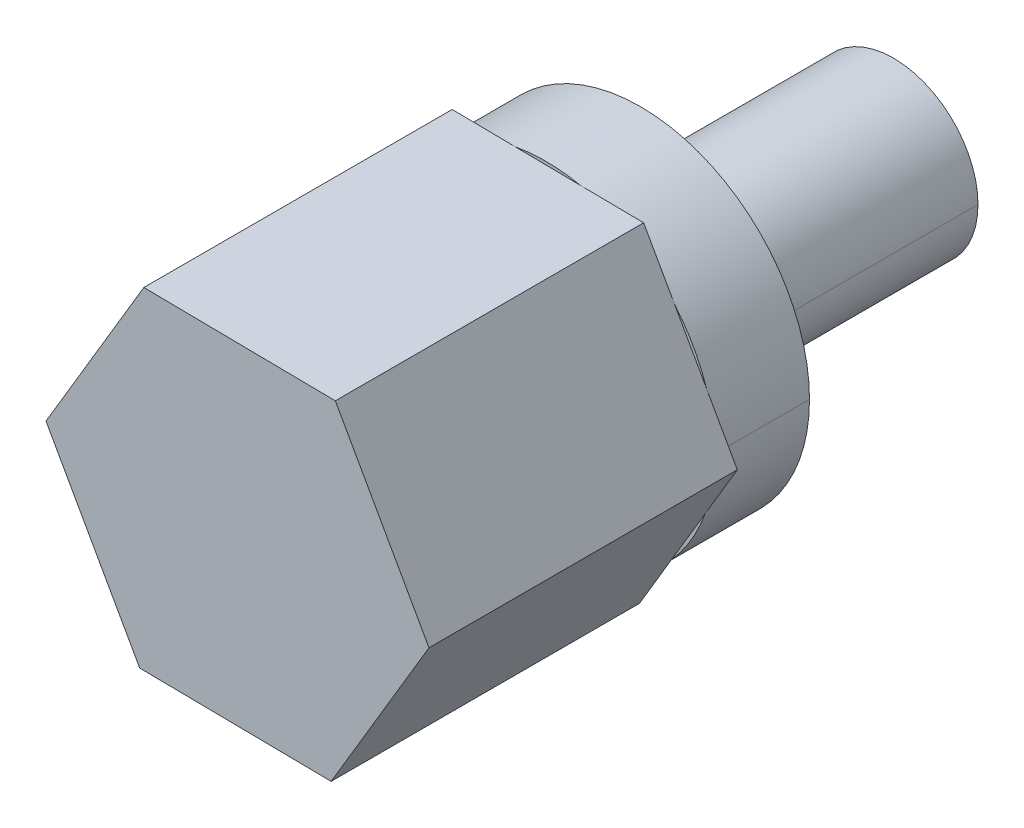
ISO-10303-21;
HEADER;
FILE_DESCRIPTION(('STEP AP214'),'2;1');
FILE_NAME('part.step','',(''),(''),'','','');
FILE_SCHEMA(('AUTOMOTIVE_DESIGN { 1 0 10303 214 1 1 1 1 }'));
ENDSEC;
DATA;
#1=APPLICATION_CONTEXT('core data for automotive mechanical design processes');
#2=APPLICATION_PROTOCOL_DEFINITION('international standard','automotive_design',2000,#1);
#3=PRODUCT_CONTEXT('',#1,'mechanical');
#4=PRODUCT('Part','Part','',(#3));
#5=PRODUCT_RELATED_PRODUCT_CATEGORY('part','',(#4));
#6=PRODUCT_DEFINITION_FORMATION('','',#4);
#7=PRODUCT_DEFINITION_CONTEXT('part definition',#1,'design');
#8=PRODUCT_DEFINITION('design','',#6,#7);
#9=PRODUCT_DEFINITION_SHAPE('','',#8);
#10=(LENGTH_UNIT() NAMED_UNIT(*) SI_UNIT(.MILLI.,.METRE.));
#11=(NAMED_UNIT(*) PLANE_ANGLE_UNIT() SI_UNIT($,.RADIAN.));
#12=(NAMED_UNIT(*) SI_UNIT($,.STERADIAN.) SOLID_ANGLE_UNIT());
#13=UNCERTAINTY_MEASURE_WITH_UNIT(LENGTH_MEASURE(1.E-05),#10,'distance_accuracy_value','');
#14=(GEOMETRIC_REPRESENTATION_CONTEXT(3) GLOBAL_UNCERTAINTY_ASSIGNED_CONTEXT((#13)) GLOBAL_UNIT_ASSIGNED_CONTEXT((#10,
#11,#12)) REPRESENTATION_CONTEXT('',''));
#15=CARTESIAN_POINT('',(0.,0.,0.));
#16=DIRECTION('',(0.,0.,1.));
#17=DIRECTION('',(1.,0.,0.));
#18=AXIS2_PLACEMENT_3D('',#15,#16,#17);
#19=CARTESIAN_POINT('',(2.23771846131786,-3.99083547241392,15.6718));
#20=DIRECTION('',(0.,0.,1.));
#21=DIRECTION('',(1.,0.,0.));
#22=AXIS2_PLACEMENT_3D('',#19,#20,#21);
#23=PLANE('',#22);
#24=DIRECTION('',(0.999921038087973,-0.0125665265316121,0.));
#25=VECTOR('',#24,1.);
#26=CARTESIAN_POINT('',(-2.33730567077559,-3.93333877022566,15.6718));
#27=LINE('',#26,#25);
#28=CARTESIAN_POINT('',(-2.33730567077559,-3.93333877022566,15.6718));
#29=VERTEX_POINT('',#28);
#30=CARTESIAN_POINT('',(2.23771846131786,-3.99083547241392,15.6718));
#31=VERTEX_POINT('',#30);
#32=EDGE_CURVE('E300',#29,#31,#27,.T.);
#33=ORIENTED_EDGE('',*,*,#32,.T.);
#34=DIRECTION('',(0.510843450257695,0.859673757496886,0.));
#35=VECTOR('',#34,1.);
#36=CARTESIAN_POINT('',(2.23771846131786,-3.99083547241392,15.6718));
#37=LINE('',#36,#35);
#38=CARTESIAN_POINT('',(4.57502413209346,-0.0574967021882604,15.6718));
#39=VERTEX_POINT('',#38);
#40=EDGE_CURVE('E350',#31,#39,#37,.T.);
#41=ORIENTED_EDGE('',*,*,#40,.T.);
#42=DIRECTION('',(-0.489077587830279,0.872240284028498,0.));
#43=VECTOR('',#42,1.);
#44=CARTESIAN_POINT('',(4.57502413209346,-0.0574967021882604,15.6718));
#45=LINE('',#44,#43);
#46=CARTESIAN_POINT('',(2.33730567077559,3.93333877022566,15.6718));
#47=VERTEX_POINT('',#46);
#48=EDGE_CURVE('E357',#39,#47,#45,.T.);
#49=ORIENTED_EDGE('',*,*,#48,.T.);
#50=DIRECTION('',(-0.999921038087973,0.0125665265316122,0.));
#51=VECTOR('',#50,1.);
#52=CARTESIAN_POINT('',(2.33730567077559,3.93333877022566,15.6718));
#53=LINE('',#52,#51);
#54=CARTESIAN_POINT('',(-2.23771846131787,3.99083547241392,15.6718));
#55=VERTEX_POINT('',#54);
#56=EDGE_CURVE('E364',#47,#55,#53,.T.);
#57=ORIENTED_EDGE('',*,*,#56,.T.);
#58=DIRECTION('',(-0.510843450257694,-0.859673757496886,0.));
#59=VECTOR('',#58,1.);
#60=CARTESIAN_POINT('',(-2.23771846131787,3.99083547241392,15.6718));
#61=LINE('',#60,#59);
#62=CARTESIAN_POINT('',(-4.57502413209346,0.0574967021882596,15.6718));
#63=VERTEX_POINT('',#62);
#64=EDGE_CURVE('E24',#55,#63,#61,.T.);
#65=ORIENTED_EDGE('',*,*,#64,.T.);
#66=DIRECTION('',(0.48907758783028,-0.872240284028498,0.));
#67=VECTOR('',#66,1.);
#68=CARTESIAN_POINT('',(-4.57502413209346,0.0574967021882596,15.6718));
#69=LINE('',#68,#67);
#70=EDGE_CURVE('E10',#63,#29,#69,.T.);
#71=ORIENTED_EDGE('',*,*,#70,.T.);
#72=EDGE_LOOP('',(#33,#41,#49,#57,#65,#71));
#73=FACE_BOUND('',#72,.T.);
#74=ADVANCED_FACE('F16',(#73),#23,.T.);
#75=CARTESIAN_POINT('',(-4.57502413209346,0.0574967021882596,15.6718));
#76=DIRECTION('',(0.872240284028498,0.489077587830279,0.));
#77=DIRECTION('',(0.,0.,-1.));
#78=AXIS2_PLACEMENT_3D('',#75,#76,#77);
#79=PLANE('',#78);
#80=DIRECTION('',(0.48907758783028,-0.872240284028498,0.));
#81=VECTOR('',#80,1.);
#82=CARTESIAN_POINT('',(-4.57502413209346,0.0574967021882596,8.3058));
#83=LINE('',#82,#81);
#84=CARTESIAN_POINT('',(-4.57502413209346,0.0574967021882596,8.3058));
#85=VERTEX_POINT('',#84);
#86=CARTESIAN_POINT('',(-3.83804531343273,-1.25686042663338,8.3058));
#87=VERTEX_POINT('',#86);
#88=EDGE_CURVE('E327',#85,#87,#83,.T.);
#89=ORIENTED_EDGE('',*,*,#88,.T.);
#90=DIRECTION('',(0.48907758783028,-0.872240284028498,0.));
#91=VECTOR('',#90,1.);
#92=CARTESIAN_POINT('',(-4.57502413209346,0.0574967021882596,8.3058));
#93=LINE('',#92,#91);
#94=CARTESIAN_POINT('',(-3.07428448943632,-2.61898164140402,8.3058));
#95=VERTEX_POINT('',#94);
#96=EDGE_CURVE('E273',#87,#95,#93,.T.);
#97=ORIENTED_EDGE('',*,*,#96,.T.);
#98=DIRECTION('',(0.48907758783028,-0.872240284028498,0.));
#99=VECTOR('',#98,1.);
#100=CARTESIAN_POINT('',(-4.57502413209346,0.0574967021882596,8.3058));
#101=LINE('',#100,#99);
#102=CARTESIAN_POINT('',(-2.33730567077559,-3.93333877022566,8.3058));
#103=VERTEX_POINT('',#102);
#104=EDGE_CURVE('E248',#95,#103,#101,.T.);
#105=ORIENTED_EDGE('',*,*,#104,.T.);
#106=DIRECTION('',(0.,0.,-1.));
#107=VECTOR('',#106,1.);
#108=CARTESIAN_POINT('',(-2.33730567077559,-3.93333877022566,15.6718));
#109=LINE('',#108,#107);
#110=EDGE_CURVE('E296',#29,#103,#109,.T.);
#111=ORIENTED_EDGE('',*,*,#110,.F.);
#112=ORIENTED_EDGE('',*,*,#70,.F.);
#113=DIRECTION('',(0.,0.,-1.));
#114=VECTOR('',#113,1.);
#115=CARTESIAN_POINT('',(-4.57502413209346,0.0574967021882596,15.6718));
#116=LINE('',#115,#114);
#117=EDGE_CURVE('E365',#63,#85,#116,.T.);
#118=ORIENTED_EDGE('',*,*,#117,.T.);
#119=EDGE_LOOP('',(#89,#97,#105,#111,#112,#118));
#120=FACE_BOUND('',#119,.T.);
#121=ADVANCED_FACE('F374',(#120),#79,.F.);
#122=CARTESIAN_POINT('',(-2.23771846131787,3.99083547241392,15.6718));
#123=DIRECTION('',(0.859673757496886,-0.510843450257694,0.));
#124=DIRECTION('',(0.,0.,-1.));
#125=AXIS2_PLACEMENT_3D('',#122,#123,#124);
#126=PLANE('',#125);
#127=DIRECTION('',(-0.510843450257694,-0.859673757496886,0.));
#128=VECTOR('',#127,1.);
#129=CARTESIAN_POINT('',(-2.23771846131787,3.99083547241392,8.3058));
#130=LINE('',#129,#128);
#131=CARTESIAN_POINT('',(-2.23771846131787,3.99083547241392,8.3058));
#132=VERTEX_POINT('',#131);
#133=CARTESIAN_POINT('',(-3.00749571519223,2.69541452899186,8.3058));
#134=VERTEX_POINT('',#133);
#135=EDGE_CURVE('E320',#132,#134,#130,.T.);
#136=ORIENTED_EDGE('',*,*,#135,.T.);
#137=DIRECTION('',(-0.510843450257694,-0.859673757496886,0.));
#138=VECTOR('',#137,1.);
#139=CARTESIAN_POINT('',(-2.23771846131787,3.99083547241392,8.3058));
#140=LINE('',#139,#138);
#141=CARTESIAN_POINT('',(-3.8052468782191,1.35291764561032,8.3058));
#142=VERTEX_POINT('',#141);
#143=EDGE_CURVE('E220',#134,#142,#140,.T.);
#144=ORIENTED_EDGE('',*,*,#143,.T.);
#145=DIRECTION('',(-0.510843450257694,-0.859673757496886,0.));
#146=VECTOR('',#145,1.);
#147=CARTESIAN_POINT('',(-2.23771846131787,3.99083547241392,8.3058));
#148=LINE('',#147,#146);
#149=EDGE_CURVE('E323',#142,#85,#148,.T.);
#150=ORIENTED_EDGE('',*,*,#149,.T.);
#151=ORIENTED_EDGE('',*,*,#117,.F.);
#152=ORIENTED_EDGE('',*,*,#64,.F.);
#153=DIRECTION('',(0.,0.,-1.));
#154=VECTOR('',#153,1.);
#155=CARTESIAN_POINT('',(-2.23771846131787,3.99083547241392,15.6718));
#156=LINE('',#155,#154);
#157=EDGE_CURVE('E361',#55,#132,#156,.T.);
#158=ORIENTED_EDGE('',*,*,#157,.T.);
#159=EDGE_LOOP('',(#136,#144,#150,#151,#152,#158));
#160=FACE_BOUND('',#159,.T.);
#161=ADVANCED_FACE('F372',(#160),#126,.F.);
#162=CARTESIAN_POINT('',(2.33730567077559,3.93333877022566,15.6718));
#163=DIRECTION('',(-0.0125665265316122,-0.999921038087973,0.));
#164=DIRECTION('',(-0.999921038087973,0.0125665265316122,0.));
#165=AXIS2_PLACEMENT_3D('',#162,#163,#164);
#166=PLANE('',#165);
#167=DIRECTION('',(-0.999921038087973,0.0125665265316122,0.));
#168=VECTOR('',#167,1.);
#169=CARTESIAN_POINT('',(2.33730567077559,3.93333877022566,8.3058));
#170=LINE('',#169,#168);
#171=CARTESIAN_POINT('',(2.33730567077559,3.93333877022566,8.3058));
#172=VERTEX_POINT('',#171);
#173=CARTESIAN_POINT('',(0.830549598240529,3.95227495562524,8.3058));
#174=VERTEX_POINT('',#173);
#175=EDGE_CURVE('E239',#172,#174,#170,.T.);
#176=ORIENTED_EDGE('',*,*,#175,.T.);
#177=DIRECTION('',(-0.999921038087973,0.0125665265316122,0.));
#178=VECTOR('',#177,1.);
#179=CARTESIAN_POINT('',(2.33730567077559,3.93333877022566,8.3058));
#180=LINE('',#179,#178);
#181=CARTESIAN_POINT('',(-0.730962388782808,3.97189928701433,8.3058));
#182=VERTEX_POINT('',#181);
#183=EDGE_CURVE('E215',#174,#182,#180,.T.);
#184=ORIENTED_EDGE('',*,*,#183,.T.);
#185=DIRECTION('',(-0.999921038087973,0.0125665265316122,0.));
#186=VECTOR('',#185,1.);
#187=CARTESIAN_POINT('',(2.33730567077559,3.93333877022566,8.3058));
#188=LINE('',#187,#186);
#189=EDGE_CURVE('E316',#182,#132,#188,.T.);
#190=ORIENTED_EDGE('',*,*,#189,.T.);
#191=ORIENTED_EDGE('',*,*,#157,.F.);
#192=ORIENTED_EDGE('',*,*,#56,.F.);
#193=DIRECTION('',(0.,0.,-1.));
#194=VECTOR('',#193,1.);
#195=CARTESIAN_POINT('',(2.33730567077559,3.93333877022566,15.6718));
#196=LINE('',#195,#194);
#197=EDGE_CURVE('E354',#47,#172,#196,.T.);
#198=ORIENTED_EDGE('',*,*,#197,.T.);
#199=EDGE_LOOP('',(#176,#184,#190,#191,#192,#198));
#200=FACE_BOUND('',#199,.T.);
#201=ADVANCED_FACE('F670',(#200),#166,.F.);
#202=CARTESIAN_POINT('',(4.57502413209346,-0.0574967021882604,15.6718));
#203=DIRECTION('',(-0.872240284028498,-0.48907758783028,0.));
#204=DIRECTION('',(-0.48907758783028,0.872240284028498,0.));
#205=AXIS2_PLACEMENT_3D('',#202,#203,#204);
#206=PLANE('',#205);
#207=DIRECTION('',(-0.489077587830279,0.872240284028498,0.));
#208=VECTOR('',#207,1.);
#209=CARTESIAN_POINT('',(4.57502413209346,-0.0574967021882604,8.3058));
#210=LINE('',#209,#208);
#211=CARTESIAN_POINT('',(4.57502413209346,-0.0574967021882604,8.3058));
#212=VERTEX_POINT('',#211);
#213=CARTESIAN_POINT('',(3.83804531343274,1.25686042663337,8.3058));
#214=VERTEX_POINT('',#213);
#215=EDGE_CURVE('E341',#212,#214,#210,.T.);
#216=ORIENTED_EDGE('',*,*,#215,.T.);
#217=DIRECTION('',(-0.489077587830279,0.872240284028498,0.));
#218=VECTOR('',#217,1.);
#219=CARTESIAN_POINT('',(4.57502413209346,-0.0574967021882604,8.3058));
#220=LINE('',#219,#218);
#221=CARTESIAN_POINT('',(3.0742844894363,2.61898164140403,8.3058));
#222=VERTEX_POINT('',#221);
#223=EDGE_CURVE('E219',#214,#222,#220,.T.);
#224=ORIENTED_EDGE('',*,*,#223,.T.);
#225=DIRECTION('',(-0.489077587830279,0.872240284028498,0.));
#226=VECTOR('',#225,1.);
#227=CARTESIAN_POINT('',(4.57502413209346,-0.0574967021882604,8.3058));
#228=LINE('',#227,#226);
#229=EDGE_CURVE('E235',#222,#172,#228,.T.);
#230=ORIENTED_EDGE('',*,*,#229,.T.);
#231=ORIENTED_EDGE('',*,*,#197,.F.);
#232=ORIENTED_EDGE('',*,*,#48,.F.);
#233=DIRECTION('',(0.,0.,-1.));
#234=VECTOR('',#233,1.);
#235=CARTESIAN_POINT('',(4.57502413209346,-0.0574967021882604,15.6718));
#236=LINE('',#235,#234);
#237=EDGE_CURVE('E299',#39,#212,#236,.T.);
#238=ORIENTED_EDGE('',*,*,#237,.T.);
#239=EDGE_LOOP('',(#216,#224,#230,#231,#232,#238));
#240=FACE_BOUND('',#239,.T.);
#241=ADVANCED_FACE('F398',(#240),#206,.F.);
#242=CARTESIAN_POINT('',(2.23771846131786,-3.99083547241392,15.6718));
#243=DIRECTION('',(-0.859673757496886,0.510843450257694,0.));
#244=DIRECTION('',(0.,0.,1.));
#245=AXIS2_PLACEMENT_3D('',#242,#243,#244);
#246=PLANE('',#245);
#247=DIRECTION('',(0.510843450257695,0.859673757496886,0.));
#248=VECTOR('',#247,1.);
#249=CARTESIAN_POINT('',(2.23771846131786,-3.99083547241392,8.3058));
#250=LINE('',#249,#248);
#251=CARTESIAN_POINT('',(2.23771846131786,-3.99083547241392,8.3058));
#252=VERTEX_POINT('',#251);
#253=CARTESIAN_POINT('',(3.00749571519222,-2.69541452899187,8.3058));
#254=VERTEX_POINT('',#253);
#255=EDGE_CURVE('E336',#252,#254,#250,.T.);
#256=ORIENTED_EDGE('',*,*,#255,.T.);
#257=DIRECTION('',(0.510843450257695,0.859673757496886,0.));
#258=VECTOR('',#257,1.);
#259=CARTESIAN_POINT('',(2.23771846131786,-3.99083547241392,8.3058));
#260=LINE('',#259,#258);
#261=CARTESIAN_POINT('',(3.80524687821911,-1.35291764561031,8.3058));
#262=VERTEX_POINT('',#261);
#263=EDGE_CURVE('E240',#254,#262,#260,.T.);
#264=ORIENTED_EDGE('',*,*,#263,.T.);
#265=DIRECTION('',(0.510843450257695,0.859673757496886,0.));
#266=VECTOR('',#265,1.);
#267=CARTESIAN_POINT('',(2.23771846131786,-3.99083547241392,8.3058));
#268=LINE('',#267,#266);
#269=EDGE_CURVE('E174',#262,#212,#268,.T.);
#270=ORIENTED_EDGE('',*,*,#269,.T.);
#271=ORIENTED_EDGE('',*,*,#237,.F.);
#272=ORIENTED_EDGE('',*,*,#40,.F.);
#273=DIRECTION('',(0.,0.,-1.));
#274=VECTOR('',#273,1.);
#275=CARTESIAN_POINT('',(2.23771846131786,-3.99083547241392,15.6718));
#276=LINE('',#275,#274);
#277=EDGE_CURVE('E342',#31,#252,#276,.T.);
#278=ORIENTED_EDGE('',*,*,#277,.T.);
#279=EDGE_LOOP('',(#256,#264,#270,#271,#272,#278));
#280=FACE_BOUND('',#279,.T.);
#281=ADVANCED_FACE('F396',(#280),#246,.F.);
#282=CARTESIAN_POINT('',(-2.33730567077559,-3.93333877022566,15.6718));
#283=DIRECTION('',(0.0125665265316121,0.999921038087973,0.));
#284=DIRECTION('',(0.,0.,-1.));
#285=AXIS2_PLACEMENT_3D('',#282,#283,#284);
#286=PLANE('',#285);
#287=DIRECTION('',(0.999921038087973,-0.0125665265316121,0.));
#288=VECTOR('',#287,1.);
#289=CARTESIAN_POINT('',(-2.33730567077559,-3.93333877022566,8.3058));
#290=LINE('',#289,#288);
#291=CARTESIAN_POINT('',(-0.830549598240519,-3.95227495562524,8.3058));
#292=VERTEX_POINT('',#291);
#293=EDGE_CURVE('E244',#103,#292,#290,.T.);
#294=ORIENTED_EDGE('',*,*,#293,.T.);
#295=DIRECTION('',(0.999921038087973,-0.0125665265316121,0.));
#296=VECTOR('',#295,1.);
#297=CARTESIAN_POINT('',(-2.33730567077559,-3.93333877022566,8.3058));
#298=LINE('',#297,#296);
#299=CARTESIAN_POINT('',(0.7309623887828,-3.97189928701433,8.3058));
#300=VERTEX_POINT('',#299);
#301=EDGE_CURVE('E253',#292,#300,#298,.T.);
#302=ORIENTED_EDGE('',*,*,#301,.T.);
#303=DIRECTION('',(0.999921038087973,-0.0125665265316121,0.));
#304=VECTOR('',#303,1.);
#305=CARTESIAN_POINT('',(-2.33730567077559,-3.93333877022566,8.3058));
#306=LINE('',#305,#304);
#307=EDGE_CURVE('E247',#300,#252,#306,.T.);
#308=ORIENTED_EDGE('',*,*,#307,.T.);
#309=ORIENTED_EDGE('',*,*,#277,.F.);
#310=ORIENTED_EDGE('',*,*,#32,.F.);
#311=ORIENTED_EDGE('',*,*,#110,.T.);
#312=EDGE_LOOP('',(#294,#302,#308,#309,#310,#311));
#313=FACE_BOUND('',#312,.T.);
#314=ADVANCED_FACE('F390',(#313),#286,.F.);
#315=CARTESIAN_POINT('',(2.23771846131786,-3.99083547241392,8.3058));
#316=DIRECTION('',(0.,0.,1.));
#317=DIRECTION('',(1.,0.,0.));
#318=AXIS2_PLACEMENT_3D('',#315,#316,#317);
#319=PLANE('',#318);
#320=ORIENTED_EDGE('',*,*,#269,.F.);
#321=CARTESIAN_POINT('',(0.,0.,8.3058));
#322=DIRECTION('',(0.,0.,1.));
#323=DIRECTION('',(1.,0.,0.));
#324=AXIS2_PLACEMENT_3D('',#321,#322,#323);
#325=CIRCLE('',#324,4.0386);
#326=CARTESIAN_POINT('',(4.0386,0.,8.3058));
#327=VERTEX_POINT('',#326);
#328=EDGE_CURVE('E167',#262,#327,#325,.T.);
#329=ORIENTED_EDGE('',*,*,#328,.T.);
#330=CARTESIAN_POINT('',(0.,0.,8.3058));
#331=DIRECTION('',(0.,0.,1.));
#332=DIRECTION('',(1.,0.,0.));
#333=AXIS2_PLACEMENT_3D('',#330,#331,#332);
#334=CIRCLE('',#333,4.0386);
#335=EDGE_CURVE('E172',#327,#214,#334,.T.);
#336=ORIENTED_EDGE('',*,*,#335,.T.);
#337=ORIENTED_EDGE('',*,*,#215,.F.);
#338=EDGE_LOOP('',(#320,#329,#336,#337));
#339=FACE_BOUND('',#338,.T.);
#340=ADVANCED_FACE('F169',(#339),#319,.F.);
#341=CARTESIAN_POINT('',(2.23771846131786,-3.99083547241392,8.3058));
#342=DIRECTION('',(0.,0.,1.));
#343=DIRECTION('',(1.,0.,0.));
#344=AXIS2_PLACEMENT_3D('',#341,#342,#343);
#345=PLANE('',#344);
#346=ORIENTED_EDGE('',*,*,#307,.F.);
#347=CARTESIAN_POINT('',(0.,0.,8.3058));
#348=DIRECTION('',(0.,0.,1.));
#349=DIRECTION('',(1.,0.,0.));
#350=AXIS2_PLACEMENT_3D('',#347,#348,#349);
#351=CIRCLE('',#350,4.0386);
#352=EDGE_CURVE('E277',#300,#254,#351,.T.);
#353=ORIENTED_EDGE('',*,*,#352,.T.);
#354=ORIENTED_EDGE('',*,*,#255,.F.);
#355=EDGE_LOOP('',(#346,#353,#354));
#356=FACE_BOUND('',#355,.T.);
#357=ADVANCED_FACE('F707',(#356),#345,.F.);
#358=CARTESIAN_POINT('',(2.23771846131786,-3.99083547241392,8.3058));
#359=DIRECTION('',(0.,0.,1.));
#360=DIRECTION('',(1.,0.,0.));
#361=AXIS2_PLACEMENT_3D('',#358,#359,#360);
#362=PLANE('',#361);
#363=ORIENTED_EDGE('',*,*,#104,.F.);
#364=CARTESIAN_POINT('',(0.,0.,8.3058));
#365=DIRECTION('',(0.,0.,1.));
#366=DIRECTION('',(1.,0.,0.));
#367=AXIS2_PLACEMENT_3D('',#364,#365,#366);
#368=CIRCLE('',#367,4.0386);
#369=EDGE_CURVE('E304',#95,#292,#368,.T.);
#370=ORIENTED_EDGE('',*,*,#369,.T.);
#371=ORIENTED_EDGE('',*,*,#293,.F.);
#372=EDGE_LOOP('',(#363,#370,#371));
#373=FACE_BOUND('',#372,.T.);
#374=ADVANCED_FACE('F388',(#373),#362,.F.);
#375=CARTESIAN_POINT('',(2.23771846131786,-3.99083547241392,8.3058));
#376=DIRECTION('',(0.,0.,1.));
#377=DIRECTION('',(1.,0.,0.));
#378=AXIS2_PLACEMENT_3D('',#375,#376,#377);
#379=PLANE('',#378);
#380=ORIENTED_EDGE('',*,*,#149,.F.);
#381=CARTESIAN_POINT('',(0.,0.,8.3058));
#382=DIRECTION('',(0.,0.,1.));
#383=DIRECTION('',(1.,0.,0.));
#384=AXIS2_PLACEMENT_3D('',#381,#382,#383);
#385=CIRCLE('',#384,4.0386);
#386=CARTESIAN_POINT('',(-4.0386,0.,8.3058));
#387=VERTEX_POINT('',#386);
#388=EDGE_CURVE('E214',#142,#387,#385,.T.);
#389=ORIENTED_EDGE('',*,*,#388,.T.);
#390=CARTESIAN_POINT('',(0.,0.,8.3058));
#391=DIRECTION('',(0.,0.,1.));
#392=DIRECTION('',(1.,0.,0.));
#393=AXIS2_PLACEMENT_3D('',#390,#391,#392);
#394=CIRCLE('',#393,4.0386);
#395=EDGE_CURVE('E308',#387,#87,#394,.T.);
#396=ORIENTED_EDGE('',*,*,#395,.T.);
#397=ORIENTED_EDGE('',*,*,#88,.F.);
#398=EDGE_LOOP('',(#380,#389,#396,#397));
#399=FACE_BOUND('',#398,.T.);
#400=ADVANCED_FACE('F376',(#399),#379,.F.);
#401=CARTESIAN_POINT('',(2.23771846131786,-3.99083547241392,8.3058));
#402=DIRECTION('',(0.,0.,1.));
#403=DIRECTION('',(1.,0.,0.));
#404=AXIS2_PLACEMENT_3D('',#401,#402,#403);
#405=PLANE('',#404);
#406=ORIENTED_EDGE('',*,*,#189,.F.);
#407=CARTESIAN_POINT('',(0.,0.,8.3058));
#408=DIRECTION('',(0.,0.,1.));
#409=DIRECTION('',(1.,0.,0.));
#410=AXIS2_PLACEMENT_3D('',#407,#408,#409);
#411=CIRCLE('',#410,4.0386);
#412=EDGE_CURVE('E228',#182,#134,#411,.T.);
#413=ORIENTED_EDGE('',*,*,#412,.T.);
#414=ORIENTED_EDGE('',*,*,#135,.F.);
#415=EDGE_LOOP('',(#406,#413,#414));
#416=FACE_BOUND('',#415,.T.);
#417=ADVANCED_FACE('F668',(#416),#405,.F.);
#418=CARTESIAN_POINT('',(2.23771846131786,-3.99083547241392,8.3058));
#419=DIRECTION('',(0.,0.,1.));
#420=DIRECTION('',(1.,0.,0.));
#421=AXIS2_PLACEMENT_3D('',#418,#419,#420);
#422=PLANE('',#421);
#423=ORIENTED_EDGE('',*,*,#229,.F.);
#424=CARTESIAN_POINT('',(0.,0.,8.3058));
#425=DIRECTION('',(0.,0.,1.));
#426=DIRECTION('',(1.,0.,0.));
#427=AXIS2_PLACEMENT_3D('',#424,#425,#426);
#428=CIRCLE('',#427,4.0386);
#429=EDGE_CURVE('E249',#222,#174,#428,.T.);
#430=ORIENTED_EDGE('',*,*,#429,.T.);
#431=ORIENTED_EDGE('',*,*,#175,.F.);
#432=EDGE_LOOP('',(#423,#430,#431));
#433=FACE_BOUND('',#432,.T.);
#434=ADVANCED_FACE('F673',(#433),#422,.F.);
#435=CARTESIAN_POINT('',(0.,0.,8.3058));
#436=DIRECTION('',(0.,0.,1.));
#437=DIRECTION('',(1.,0.,0.));
#438=AXIS2_PLACEMENT_3D('',#435,#436,#437);
#439=PLANE('',#438);
#440=ORIENTED_EDGE('',*,*,#263,.F.);
#441=CARTESIAN_POINT('',(0.,0.,8.3058));
#442=DIRECTION('',(0.,0.,1.));
#443=DIRECTION('',(1.,0.,0.));
#444=AXIS2_PLACEMENT_3D('',#441,#442,#443);
#445=CIRCLE('',#444,4.0386);
#446=EDGE_CURVE('E179',#254,#262,#445,.T.);
#447=ORIENTED_EDGE('',*,*,#446,.T.);
#448=EDGE_LOOP('',(#440,#447));
#449=FACE_BOUND('',#448,.T.);
#450=ADVANCED_FACE('F717',(#449),#439,.T.);
#451=CARTESIAN_POINT('',(0.,0.,8.3058));
#452=DIRECTION('',(0.,0.,-1.));
#453=DIRECTION('',(-1.,0.,0.));
#454=AXIS2_PLACEMENT_3D('',#451,#452,#453);
#455=CYLINDRICAL_SURFACE('',#454,4.0386);
#456=DIRECTION('',(0.,0.,-1.));
#457=VECTOR('',#456,1.);
#458=CARTESIAN_POINT('',(4.0386,0.,8.3058));
#459=LINE('',#458,#457);
#460=CARTESIAN_POINT('',(4.0386,0.,6.0452));
#461=VERTEX_POINT('',#460);
#462=EDGE_CURVE('E183',#327,#461,#459,.T.);
#463=ORIENTED_EDGE('',*,*,#462,.F.);
#464=ORIENTED_EDGE('',*,*,#328,.F.);
#465=ORIENTED_EDGE('',*,*,#446,.F.);
#466=ORIENTED_EDGE('',*,*,#352,.F.);
#467=CARTESIAN_POINT('',(0.,0.,8.3058));
#468=DIRECTION('',(0.,0.,1.));
#469=DIRECTION('',(1.,0.,0.));
#470=AXIS2_PLACEMENT_3D('',#467,#468,#469);
#471=CIRCLE('',#470,4.0386);
#472=EDGE_CURVE('E257',#292,#300,#471,.T.);
#473=ORIENTED_EDGE('',*,*,#472,.F.);
#474=ORIENTED_EDGE('',*,*,#369,.F.);
#475=CARTESIAN_POINT('',(0.,0.,8.3058));
#476=DIRECTION('',(0.,0.,1.));
#477=DIRECTION('',(1.,0.,0.));
#478=AXIS2_PLACEMENT_3D('',#475,#476,#477);
#479=CIRCLE('',#478,4.0386);
#480=EDGE_CURVE('E281',#87,#95,#479,.T.);
#481=ORIENTED_EDGE('',*,*,#480,.F.);
#482=ORIENTED_EDGE('',*,*,#395,.F.);
#483=DIRECTION('',(0.,0.,-1.));
#484=VECTOR('',#483,1.);
#485=CARTESIAN_POINT('',(-4.0386,0.,8.3058));
#486=LINE('',#485,#484);
#487=CARTESIAN_POINT('',(-4.0386,0.,6.0452));
#488=VERTEX_POINT('',#487);
#489=EDGE_CURVE('E211',#387,#488,#486,.T.);
#490=ORIENTED_EDGE('',*,*,#489,.T.);
#491=CARTESIAN_POINT('',(0.,0.,6.0452));
#492=DIRECTION('',(0.,0.,1.));
#493=DIRECTION('',(1.,0.,0.));
#494=AXIS2_PLACEMENT_3D('',#491,#492,#493);
#495=CIRCLE('',#494,4.0386);
#496=EDGE_CURVE('E180',#488,#461,#495,.T.);
#497=ORIENTED_EDGE('',*,*,#496,.T.);
#498=EDGE_LOOP('',(#463,#464,#465,#466,#473,#474,#481,#482,#490,#497));
#499=FACE_BOUND('',#498,.T.);
#500=ADVANCED_FACE('F184',(#499),#455,.T.);
#501=CARTESIAN_POINT('',(0.,0.,6.0452));
#502=DIRECTION('',(0.,0.,1.));
#503=DIRECTION('',(1.,0.,0.));
#504=AXIS2_PLACEMENT_3D('',#501,#502,#503);
#505=PLANE('',#504);
#506=CARTESIAN_POINT('',(0.,0.,6.0452));
#507=DIRECTION('',(0.,0.,1.));
#508=DIRECTION('',(1.,0.,0.));
#509=AXIS2_PLACEMENT_3D('',#506,#507,#508);
#510=CIRCLE('',#509,2.0193);
#511=CARTESIAN_POINT('',(-2.0193,0.,6.0452));
#512=VERTEX_POINT('',#511);
#513=CARTESIAN_POINT('',(2.0193,0.,6.0452));
#514=VERTEX_POINT('',#513);
#515=EDGE_CURVE('E291',#512,#514,#510,.T.);
#516=ORIENTED_EDGE('',*,*,#515,.T.);
#517=CARTESIAN_POINT('',(0.,0.,6.0452));
#518=DIRECTION('',(0.,0.,1.));
#519=DIRECTION('',(1.,0.,0.));
#520=AXIS2_PLACEMENT_3D('',#517,#518,#519);
#521=CIRCLE('',#520,2.0193);
#522=EDGE_CURVE('E234',#514,#512,#521,.T.);
#523=ORIENTED_EDGE('',*,*,#522,.T.);
#524=EDGE_LOOP('',(#516,#523));
#525=FACE_BOUND('',#524,.T.);
#526=ORIENTED_EDGE('',*,*,#496,.F.);
#527=CARTESIAN_POINT('',(0.,0.,6.0452));
#528=DIRECTION('',(0.,0.,1.));
#529=DIRECTION('',(1.,0.,0.));
#530=AXIS2_PLACEMENT_3D('',#527,#528,#529);
#531=CIRCLE('',#530,4.0386);
#532=EDGE_CURVE('E190',#461,#488,#531,.T.);
#533=ORIENTED_EDGE('',*,*,#532,.F.);
#534=EDGE_LOOP('',(#526,#533));
#535=FACE_BOUND('',#534,.T.);
#536=ADVANCED_FACE('F718',(#525,#535),#505,.F.);
#537=CARTESIAN_POINT('',(0.,0.,0.));
#538=DIRECTION('',(0.,0.,1.));
#539=DIRECTION('',(1.,0.,0.));
#540=AXIS2_PLACEMENT_3D('',#537,#538,#539);
#541=PLANE('',#540);
#542=CARTESIAN_POINT('',(0.,0.,0.));
#543=DIRECTION('',(0.,0.,1.));
#544=DIRECTION('',(1.,0.,0.));
#545=AXIS2_PLACEMENT_3D('',#542,#543,#544);
#546=CIRCLE('',#545,2.0193);
#547=CARTESIAN_POINT('',(-2.0193,0.,0.));
#548=VERTEX_POINT('',#547);
#549=CARTESIAN_POINT('',(2.0193,0.,0.));
#550=VERTEX_POINT('',#549);
#551=EDGE_CURVE('E207',#548,#550,#546,.T.);
#552=ORIENTED_EDGE('',*,*,#551,.F.);
#553=CARTESIAN_POINT('',(0.,0.,0.));
#554=DIRECTION('',(0.,0.,1.));
#555=DIRECTION('',(1.,0.,0.));
#556=AXIS2_PLACEMENT_3D('',#553,#554,#555);
#557=CIRCLE('',#556,2.0193);
#558=EDGE_CURVE('E233',#550,#548,#557,.T.);
#559=ORIENTED_EDGE('',*,*,#558,.F.);
#560=EDGE_LOOP('',(#552,#559));
#561=FACE_BOUND('',#560,.T.);
#562=ADVANCED_FACE('F686',(#561),#541,.F.);
#563=CARTESIAN_POINT('',(0.,0.,6.0452));
#564=DIRECTION('',(0.,0.,-1.));
#565=DIRECTION('',(-1.,0.,0.));
#566=AXIS2_PLACEMENT_3D('',#563,#564,#565);
#567=CYLINDRICAL_SURFACE('',#566,2.0193);
#568=DIRECTION('',(0.,0.,-1.));
#569=VECTOR('',#568,1.);
#570=CARTESIAN_POINT('',(2.0193,0.,6.0452));
#571=LINE('',#570,#569);
#572=EDGE_CURVE('E229',#514,#550,#571,.T.);
#573=ORIENTED_EDGE('',*,*,#572,.F.);
#574=ORIENTED_EDGE('',*,*,#515,.F.);
#575=DIRECTION('',(0.,0.,-1.));
#576=VECTOR('',#575,1.);
#577=CARTESIAN_POINT('',(-2.0193,0.,6.0452));
#578=LINE('',#577,#576);
#579=EDGE_CURVE('E258',#512,#548,#578,.T.);
#580=ORIENTED_EDGE('',*,*,#579,.T.);
#581=ORIENTED_EDGE('',*,*,#551,.T.);
#582=EDGE_LOOP('',(#573,#574,#580,#581));
#583=FACE_BOUND('',#582,.T.);
#584=ADVANCED_FACE('F677',(#583),#567,.T.);
#585=CARTESIAN_POINT('',(0.,0.,8.3058));
#586=DIRECTION('',(0.,0.,1.));
#587=DIRECTION('',(1.,0.,0.));
#588=AXIS2_PLACEMENT_3D('',#585,#586,#587);
#589=PLANE('',#588);
#590=ORIENTED_EDGE('',*,*,#223,.F.);
#591=CARTESIAN_POINT('',(0.,0.,8.3058));
#592=DIRECTION('',(0.,0.,1.));
#593=DIRECTION('',(1.,0.,0.));
#594=AXIS2_PLACEMENT_3D('',#591,#592,#593);
#595=CIRCLE('',#594,4.0386);
#596=EDGE_CURVE('E196',#214,#222,#595,.T.);
#597=ORIENTED_EDGE('',*,*,#596,.T.);
#598=EDGE_LOOP('',(#590,#597));
#599=FACE_BOUND('',#598,.T.);
#600=ADVANCED_FACE('F675',(#599),#589,.T.);
#601=CARTESIAN_POINT('',(0.,0.,8.3058));
#602=DIRECTION('',(0.,0.,1.));
#603=DIRECTION('',(1.,0.,0.));
#604=AXIS2_PLACEMENT_3D('',#601,#602,#603);
#605=PLANE('',#604);
#606=ORIENTED_EDGE('',*,*,#183,.F.);
#607=CARTESIAN_POINT('',(0.,0.,8.3058));
#608=DIRECTION('',(0.,0.,1.));
#609=DIRECTION('',(1.,0.,0.));
#610=AXIS2_PLACEMENT_3D('',#607,#608,#609);
#611=CIRCLE('',#610,4.0386);
#612=EDGE_CURVE('E204',#174,#182,#611,.T.);
#613=ORIENTED_EDGE('',*,*,#612,.T.);
#614=EDGE_LOOP('',(#606,#613));
#615=FACE_BOUND('',#614,.T.);
#616=ADVANCED_FACE('F664',(#615),#605,.T.);
#617=CARTESIAN_POINT('',(0.,0.,8.3058));
#618=DIRECTION('',(0.,0.,1.));
#619=DIRECTION('',(1.,0.,0.));
#620=AXIS2_PLACEMENT_3D('',#617,#618,#619);
#621=PLANE('',#620);
#622=ORIENTED_EDGE('',*,*,#143,.F.);
#623=CARTESIAN_POINT('',(0.,0.,8.3058));
#624=DIRECTION('',(0.,0.,1.));
#625=DIRECTION('',(1.,0.,0.));
#626=AXIS2_PLACEMENT_3D('',#623,#624,#625);
#627=CIRCLE('',#626,4.0386);
#628=EDGE_CURVE('E224',#134,#142,#627,.T.);
#629=ORIENTED_EDGE('',*,*,#628,.T.);
#630=EDGE_LOOP('',(#622,#629));
#631=FACE_BOUND('',#630,.T.);
#632=ADVANCED_FACE('F684',(#631),#621,.T.);
#633=CARTESIAN_POINT('',(0.,0.,8.3058));
#634=DIRECTION('',(0.,0.,1.));
#635=DIRECTION('',(1.,0.,0.));
#636=AXIS2_PLACEMENT_3D('',#633,#634,#635);
#637=PLANE('',#636);
#638=ORIENTED_EDGE('',*,*,#96,.F.);
#639=ORIENTED_EDGE('',*,*,#480,.T.);
#640=EDGE_LOOP('',(#638,#639));
#641=FACE_BOUND('',#640,.T.);
#642=ADVANCED_FACE('F384',(#641),#637,.T.);
#643=CARTESIAN_POINT('',(0.,0.,8.3058));
#644=DIRECTION('',(0.,0.,1.));
#645=DIRECTION('',(1.,0.,0.));
#646=AXIS2_PLACEMENT_3D('',#643,#644,#645);
#647=PLANE('',#646);
#648=ORIENTED_EDGE('',*,*,#301,.F.);
#649=ORIENTED_EDGE('',*,*,#472,.T.);
#650=EDGE_LOOP('',(#648,#649));
#651=FACE_BOUND('',#650,.T.);
#652=ADVANCED_FACE('F740',(#651),#647,.T.);
#653=CARTESIAN_POINT('',(0.,0.,6.0452));
#654=DIRECTION('',(0.,0.,-1.));
#655=DIRECTION('',(-1.,0.,0.));
#656=AXIS2_PLACEMENT_3D('',#653,#654,#655);
#657=CYLINDRICAL_SURFACE('',#656,2.0193);
#658=ORIENTED_EDGE('',*,*,#522,.F.);
#659=ORIENTED_EDGE('',*,*,#572,.T.);
#660=ORIENTED_EDGE('',*,*,#558,.T.);
#661=ORIENTED_EDGE('',*,*,#579,.F.);
#662=EDGE_LOOP('',(#658,#659,#660,#661));
#663=FACE_BOUND('',#662,.T.);
#664=ADVANCED_FACE('F736',(#663),#657,.T.);
#665=CARTESIAN_POINT('',(0.,0.,8.3058));
#666=DIRECTION('',(0.,0.,-1.));
#667=DIRECTION('',(-1.,0.,0.));
#668=AXIS2_PLACEMENT_3D('',#665,#666,#667);
#669=CYLINDRICAL_SURFACE('',#668,4.0386);
#670=ORIENTED_EDGE('',*,*,#335,.F.);
#671=ORIENTED_EDGE('',*,*,#462,.T.);
#672=ORIENTED_EDGE('',*,*,#532,.T.);
#673=ORIENTED_EDGE('',*,*,#489,.F.);
#674=ORIENTED_EDGE('',*,*,#388,.F.);
#675=ORIENTED_EDGE('',*,*,#628,.F.);
#676=ORIENTED_EDGE('',*,*,#412,.F.);
#677=ORIENTED_EDGE('',*,*,#612,.F.);
#678=ORIENTED_EDGE('',*,*,#429,.F.);
#679=ORIENTED_EDGE('',*,*,#596,.F.);
#680=EDGE_LOOP('',(#670,#671,#672,#673,#674,#675,#676,#677,#678,#679));
#681=FACE_BOUND('',#680,.T.);
#682=ADVANCED_FACE('F193',(#681),#669,.T.);
#683=CLOSED_SHELL('',(#74,#121,#161,#201,#241,#281,#314,#340,#357,#374,#400,#417,#434,#450,#500,
#536,#562,#584,#600,#616,#632,#642,#652,#664,#682));
#684=MANIFOLD_SOLID_BREP('B1',#683);
#685=ADVANCED_BREP_SHAPE_REPRESENTATION('',(#18,#684),#14);
#686=SHAPE_DEFINITION_REPRESENTATION(#9,#685);
ENDSEC;
END-ISO-10303-21;
